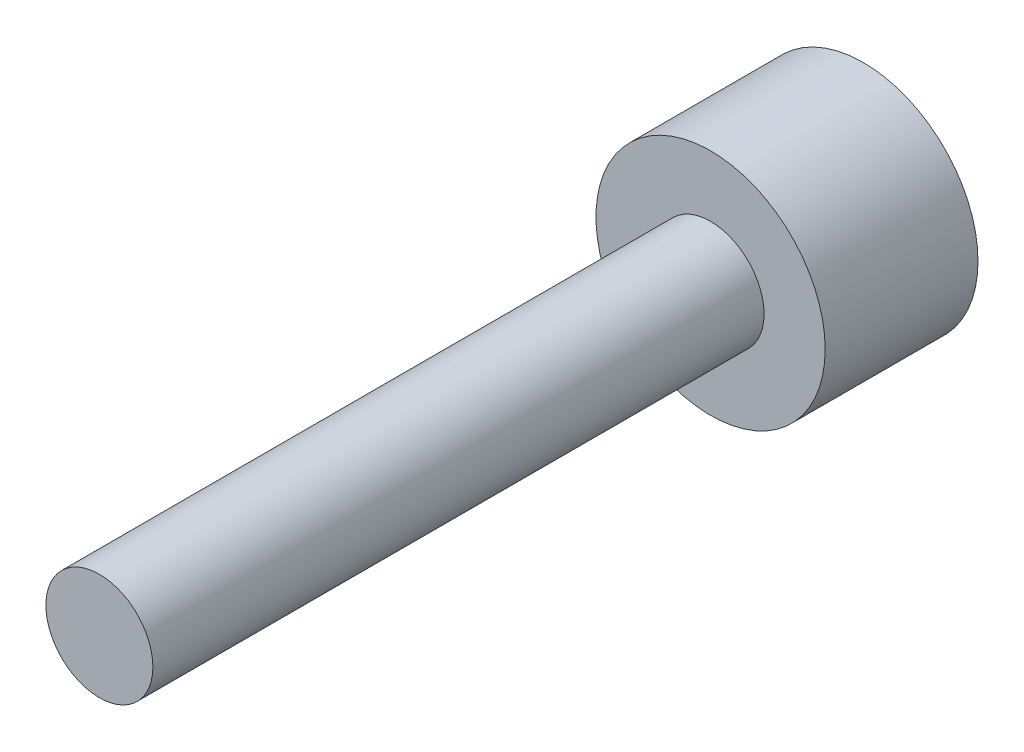
ISO-10303-21;
HEADER;
FILE_DESCRIPTION(('STEP AP214'),'2;1');
FILE_NAME('part.step','',(''),(''),'','','');
FILE_SCHEMA(('AUTOMOTIVE_DESIGN { 1 0 10303 214 1 1 1 1 }'));
ENDSEC;
DATA;
#1=APPLICATION_CONTEXT('core data for automotive mechanical design processes');
#2=APPLICATION_PROTOCOL_DEFINITION('international standard','automotive_design',2000,#1);
#3=PRODUCT_CONTEXT('',#1,'mechanical');
#4=PRODUCT('Part','Part','',(#3));
#5=PRODUCT_RELATED_PRODUCT_CATEGORY('part','',(#4));
#6=PRODUCT_DEFINITION_FORMATION('','',#4);
#7=PRODUCT_DEFINITION_CONTEXT('part definition',#1,'design');
#8=PRODUCT_DEFINITION('design','',#6,#7);
#9=PRODUCT_DEFINITION_SHAPE('','',#8);
#10=(LENGTH_UNIT() NAMED_UNIT(*) SI_UNIT(.MILLI.,.METRE.));
#11=(NAMED_UNIT(*) PLANE_ANGLE_UNIT() SI_UNIT($,.RADIAN.));
#12=(NAMED_UNIT(*) SI_UNIT($,.STERADIAN.) SOLID_ANGLE_UNIT());
#13=UNCERTAINTY_MEASURE_WITH_UNIT(LENGTH_MEASURE(1.E-05),#10,'distance_accuracy_value','');
#14=(GEOMETRIC_REPRESENTATION_CONTEXT(3) GLOBAL_UNCERTAINTY_ASSIGNED_CONTEXT((#13)) GLOBAL_UNIT_ASSIGNED_CONTEXT((#10,
#11,#12)) REPRESENTATION_CONTEXT('',''));
#15=CARTESIAN_POINT('',(0.,0.,0.));
#16=DIRECTION('',(0.,0.,1.));
#17=DIRECTION('',(1.,0.,0.));
#18=AXIS2_PLACEMENT_3D('',#15,#16,#17);
#19=CARTESIAN_POINT('',(0.,0.,10.));
#20=DIRECTION('',(0.,0.,-1.));
#21=DIRECTION('',(-1.,0.,0.));
#22=AXIS2_PLACEMENT_3D('',#19,#20,#21);
#23=CYLINDRICAL_SURFACE('',#22,0.7);
#24=CARTESIAN_POINT('',(0.,0.,2.));
#25=DIRECTION('',(0.,0.,1.));
#26=DIRECTION('',(1.,0.,0.));
#27=AXIS2_PLACEMENT_3D('',#24,#25,#26);
#28=CIRCLE('',#27,0.7);
#29=CARTESIAN_POINT('',(0.7,0.,2.));
#30=VERTEX_POINT('',#29);
#31=EDGE_CURVE('E40',#30,#30,#28,.T.);
#32=ORIENTED_EDGE('',*,*,#31,.T.);
#33=EDGE_LOOP('',(#32));
#34=FACE_BOUND('',#33,.T.);
#35=CARTESIAN_POINT('',(0.,0.,10.));
#36=DIRECTION('',(0.,0.,1.));
#37=DIRECTION('',(1.,0.,0.));
#38=AXIS2_PLACEMENT_3D('',#35,#36,#37);
#39=CIRCLE('',#38,0.7);
#40=CARTESIAN_POINT('',(0.7,0.,10.));
#41=VERTEX_POINT('',#40);
#42=EDGE_CURVE('E10',#41,#41,#39,.T.);
#43=ORIENTED_EDGE('',*,*,#42,.F.);
#44=EDGE_LOOP('',(#43));
#45=FACE_BOUND('',#44,.T.);
#46=ADVANCED_FACE('F37',(#34,#45),#23,.T.);
#47=CARTESIAN_POINT('',(0.,0.,10.));
#48=DIRECTION('',(0.,0.,1.));
#49=DIRECTION('',(1.,0.,0.));
#50=AXIS2_PLACEMENT_3D('',#47,#48,#49);
#51=PLANE('',#50);
#52=ORIENTED_EDGE('',*,*,#42,.T.);
#53=EDGE_LOOP('',(#52));
#54=FACE_BOUND('',#53,.T.);
#55=ADVANCED_FACE('F64',(#54),#51,.T.);
#56=CARTESIAN_POINT('',(0.,0.,2.));
#57=DIRECTION('',(0.,0.,-1.));
#58=DIRECTION('',(-1.,0.,0.));
#59=AXIS2_PLACEMENT_3D('',#56,#57,#58);
#60=CYLINDRICAL_SURFACE('',#59,1.5);
#61=CARTESIAN_POINT('',(0.,0.,2.));
#62=DIRECTION('',(0.,0.,1.));
#63=DIRECTION('',(1.,0.,0.));
#64=AXIS2_PLACEMENT_3D('',#61,#62,#63);
#65=CIRCLE('',#64,1.5);
#66=CARTESIAN_POINT('',(1.5,0.,2.));
#67=VERTEX_POINT('',#66);
#68=EDGE_CURVE('E49',#67,#67,#65,.T.);
#69=ORIENTED_EDGE('',*,*,#68,.F.);
#70=EDGE_LOOP('',(#69));
#71=FACE_BOUND('',#70,.T.);
#72=CARTESIAN_POINT('',(0.,0.,0.));
#73=DIRECTION('',(0.,0.,1.));
#74=DIRECTION('',(1.,0.,0.));
#75=AXIS2_PLACEMENT_3D('',#72,#73,#74);
#76=CIRCLE('',#75,1.5);
#77=CARTESIAN_POINT('',(1.5,0.,0.));
#78=VERTEX_POINT('',#77);
#79=EDGE_CURVE('E51',#78,#78,#76,.T.);
#80=ORIENTED_EDGE('',*,*,#79,.T.);
#81=EDGE_LOOP('',(#80));
#82=FACE_BOUND('',#81,.T.);
#83=ADVANCED_FACE('F61',(#71,#82),#60,.T.);
#84=CARTESIAN_POINT('',(0.,0.,2.));
#85=DIRECTION('',(0.,0.,1.));
#86=DIRECTION('',(1.,0.,0.));
#87=AXIS2_PLACEMENT_3D('',#84,#85,#86);
#88=PLANE('',#87);
#89=ORIENTED_EDGE('',*,*,#31,.F.);
#90=EDGE_LOOP('',(#89));
#91=FACE_BOUND('',#90,.T.);
#92=ORIENTED_EDGE('',*,*,#68,.T.);
#93=EDGE_LOOP('',(#92));
#94=FACE_BOUND('',#93,.T.);
#95=ADVANCED_FACE('F59',(#91,#94),#88,.T.);
#96=CARTESIAN_POINT('',(0.,0.,0.));
#97=DIRECTION('',(0.,0.,1.));
#98=DIRECTION('',(1.,0.,0.));
#99=AXIS2_PLACEMENT_3D('',#96,#97,#98);
#100=PLANE('',#99);
#101=ORIENTED_EDGE('',*,*,#79,.F.);
#102=EDGE_LOOP('',(#101));
#103=FACE_BOUND('',#102,.T.);
#104=ADVANCED_FACE('F68',(#103),#100,.F.);
#105=CLOSED_SHELL('',(#46,#55,#83,#95,#104));
#106=MANIFOLD_SOLID_BREP('B2',#105);
#107=ADVANCED_BREP_SHAPE_REPRESENTATION('',(#18,#106),#14);
#108=SHAPE_DEFINITION_REPRESENTATION(#9,#107);
ENDSEC;
END-ISO-10303-21;
